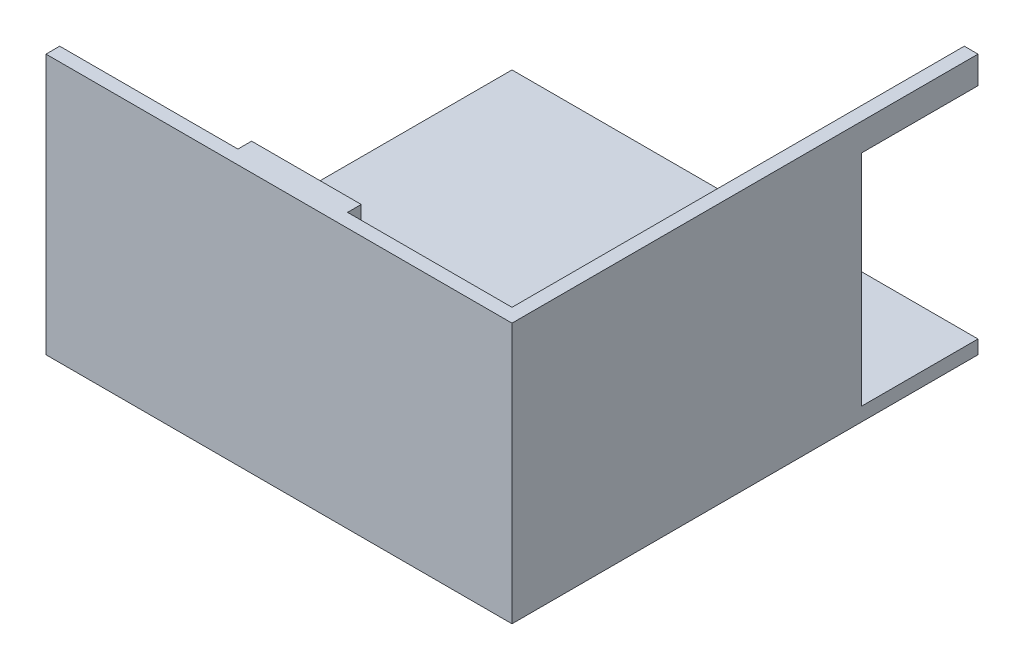
ISO-10303-21;
HEADER;
FILE_DESCRIPTION(('STEP AP214'),'2;1');
FILE_NAME('part.step','',(''),(''),'','','');
FILE_SCHEMA(('AUTOMOTIVE_DESIGN { 1 0 10303 214 1 1 1 1 }'));
ENDSEC;
DATA;
#1=APPLICATION_CONTEXT('core data for automotive mechanical design processes');
#2=APPLICATION_PROTOCOL_DEFINITION('international standard','automotive_design',2000,#1);
#3=PRODUCT_CONTEXT('',#1,'mechanical');
#4=PRODUCT('Part','Part','',(#3));
#5=PRODUCT_RELATED_PRODUCT_CATEGORY('part','',(#4));
#6=PRODUCT_DEFINITION_FORMATION('','',#4);
#7=PRODUCT_DEFINITION_CONTEXT('part definition',#1,'design');
#8=PRODUCT_DEFINITION('design','',#6,#7);
#9=PRODUCT_DEFINITION_SHAPE('','',#8);
#10=(LENGTH_UNIT() NAMED_UNIT(*) SI_UNIT(.MILLI.,.METRE.));
#11=(NAMED_UNIT(*) PLANE_ANGLE_UNIT() SI_UNIT($,.RADIAN.));
#12=(NAMED_UNIT(*) SI_UNIT($,.STERADIAN.) SOLID_ANGLE_UNIT());
#13=UNCERTAINTY_MEASURE_WITH_UNIT(LENGTH_MEASURE(1.E-05),#10,'distance_accuracy_value','');
#14=(GEOMETRIC_REPRESENTATION_CONTEXT(3) GLOBAL_UNCERTAINTY_ASSIGNED_CONTEXT((#13)) GLOBAL_UNIT_ASSIGNED_CONTEXT((#10,
#11,#12)) REPRESENTATION_CONTEXT('',''));
#15=CARTESIAN_POINT('',(0.,0.,0.));
#16=DIRECTION('',(0.,0.,1.));
#17=DIRECTION('',(1.,0.,0.));
#18=AXIS2_PLACEMENT_3D('',#15,#16,#17);
#19=CARTESIAN_POINT('',(-62.5225359911407,228.6,-371.401162790698));
#20=DIRECTION('',(0.,0.,1.));
#21=DIRECTION('',(1.,0.,0.));
#22=AXIS2_PLACEMENT_3D('',#19,#20,#21);
#23=PLANE('',#22);
#24=DIRECTION('',(-1.,0.,0.));
#25=VECTOR('',#24,1.);
#26=CARTESIAN_POINT('',(356.577464008859,0.,-371.401162790698));
#27=LINE('',#26,#25);
#28=CARTESIAN_POINT('',(369.277464008859,0.,-371.401162790698));
#29=VERTEX_POINT('',#28);
#30=CARTESIAN_POINT('',(-62.5225359911407,0.,-371.401162790698));
#31=VERTEX_POINT('',#30);
#32=EDGE_CURVE('E242',#29,#31,#27,.T.);
#33=ORIENTED_EDGE('',*,*,#32,.F.);
#34=DIRECTION('',(0.,-1.,0.));
#35=VECTOR('',#34,1.);
#36=CARTESIAN_POINT('',(369.277464008859,228.6,-371.401162790698));
#37=LINE('',#36,#35);
#38=CARTESIAN_POINT('',(369.277464008859,-12.7,-371.401162790698));
#39=VERTEX_POINT('',#38);
#40=EDGE_CURVE('E205',#29,#39,#37,.T.);
#41=ORIENTED_EDGE('',*,*,#40,.T.);
#42=DIRECTION('',(1.,0.,0.));
#43=VECTOR('',#42,1.);
#44=CARTESIAN_POINT('',(369.277464008859,-12.7,-371.401162790698));
#45=LINE('',#44,#43);
#46=CARTESIAN_POINT('',(-62.5225359911407,-12.7,-371.401162790698));
#47=VERTEX_POINT('',#46);
#48=EDGE_CURVE('E234',#47,#39,#45,.T.);
#49=ORIENTED_EDGE('',*,*,#48,.F.);
#50=DIRECTION('',(0.,-1.,0.));
#51=VECTOR('',#50,1.);
#52=CARTESIAN_POINT('',(-62.5225359911407,228.6,-371.401162790698));
#53=LINE('',#52,#51);
#54=EDGE_CURVE('E203',#31,#47,#53,.T.);
#55=ORIENTED_EDGE('',*,*,#54,.F.);
#56=EDGE_LOOP('',(#33,#41,#49,#55));
#57=FACE_BOUND('',#56,.T.);
#58=ADVANCED_FACE('F53',(#57),#23,.F.);
#59=CARTESIAN_POINT('',(356.577464008859,228.6,-371.401162790698));
#60=DIRECTION('',(-1.,0.,0.));
#61=DIRECTION('',(0.,0.,1.));
#62=AXIS2_PLACEMENT_3D('',#59,#60,#61);
#63=PLANE('',#62);
#64=DIRECTION('',(0.,0.,1.));
#65=VECTOR('',#64,1.);
#66=CARTESIAN_POINT('',(356.577464008859,203.2,-371.401162790698));
#67=LINE('',#66,#65);
#68=CARTESIAN_POINT('',(356.577464008859,203.2,-371.401162790698));
#69=VERTEX_POINT('',#68);
#70=CARTESIAN_POINT('',(356.577464008859,203.2,-263.451162790698));
#71=VERTEX_POINT('',#70);
#72=EDGE_CURVE('E175',#69,#71,#67,.T.);
#73=ORIENTED_EDGE('',*,*,#72,.T.);
#74=DIRECTION('',(0.,-1.,0.));
#75=VECTOR('',#74,1.);
#76=CARTESIAN_POINT('',(356.577464008859,203.2,-263.451162790698));
#77=LINE('',#76,#75);
#78=CARTESIAN_POINT('',(356.577464008859,0.,-263.451162790698));
#79=VERTEX_POINT('',#78);
#80=EDGE_CURVE('E159',#71,#79,#77,.T.);
#81=ORIENTED_EDGE('',*,*,#80,.T.);
#82=DIRECTION('',(0.,0.,-1.));
#83=VECTOR('',#82,1.);
#84=CARTESIAN_POINT('',(356.577464008859,0.,-371.401162790698));
#85=LINE('',#84,#83);
#86=CARTESIAN_POINT('',(356.577464008859,0.,47.6988372093023));
#87=VERTEX_POINT('',#86);
#88=EDGE_CURVE('E173',#87,#79,#85,.T.);
#89=ORIENTED_EDGE('',*,*,#88,.F.);
#90=DIRECTION('',(0.,-1.,0.));
#91=VECTOR('',#90,1.);
#92=CARTESIAN_POINT('',(356.577464008859,228.6,47.6988372093023));
#93=LINE('',#92,#91);
#94=CARTESIAN_POINT('',(356.577464008859,228.6,47.6988372093023));
#95=VERTEX_POINT('',#94);
#96=EDGE_CURVE('E194',#95,#87,#93,.T.);
#97=ORIENTED_EDGE('',*,*,#96,.F.);
#98=DIRECTION('',(0.,0.,-1.));
#99=VECTOR('',#98,1.);
#100=CARTESIAN_POINT('',(356.577464008859,228.6,-371.401162790698));
#101=LINE('',#100,#99);
#102=CARTESIAN_POINT('',(356.577464008859,228.6,-371.401162790698));
#103=VERTEX_POINT('',#102);
#104=EDGE_CURVE('E192',#95,#103,#101,.T.);
#105=ORIENTED_EDGE('',*,*,#104,.T.);
#106=DIRECTION('',(0.,-1.,0.));
#107=VECTOR('',#106,1.);
#108=CARTESIAN_POINT('',(356.577464008859,228.6,-371.401162790698));
#109=LINE('',#108,#107);
#110=EDGE_CURVE('E240',#103,#69,#109,.T.);
#111=ORIENTED_EDGE('',*,*,#110,.T.);
#112=EDGE_LOOP('',(#73,#81,#89,#97,#105,#111));
#113=FACE_BOUND('',#112,.T.);
#114=ADVANCED_FACE('F171',(#113),#63,.T.);
#115=CARTESIAN_POINT('',(-62.5225359911406,228.6,47.6988372093023));
#116=DIRECTION('',(0.,0.,-1.));
#117=DIRECTION('',(-1.,0.,0.));
#118=AXIS2_PLACEMENT_3D('',#115,#116,#117);
#119=PLANE('',#118);
#120=DIRECTION('',(1.,0.,0.));
#121=VECTOR('',#120,1.);
#122=CARTESIAN_POINT('',(-62.5225359911406,0.,47.6988372093023));
#123=LINE('',#122,#121);
#124=CARTESIAN_POINT('',(204.177464008859,0.,47.6988372093023));
#125=VERTEX_POINT('',#124);
#126=EDGE_CURVE('E180',#125,#87,#123,.T.);
#127=ORIENTED_EDGE('',*,*,#126,.F.);
#128=DIRECTION('',(0.,1.,0.));
#129=VECTOR('',#128,1.);
#130=CARTESIAN_POINT('',(204.177464008859,228.6,47.6988372093023));
#131=LINE('',#130,#129);
#132=CARTESIAN_POINT('',(204.177464008859,228.6,47.6988372093023));
#133=VERTEX_POINT('',#132);
#134=EDGE_CURVE('E247',#125,#133,#131,.T.);
#135=ORIENTED_EDGE('',*,*,#134,.T.);
#136=DIRECTION('',(1.,0.,0.));
#137=VECTOR('',#136,1.);
#138=CARTESIAN_POINT('',(-62.5225359911406,228.6,47.6988372093023));
#139=LINE('',#138,#137);
#140=EDGE_CURVE('E182',#133,#95,#139,.T.);
#141=ORIENTED_EDGE('',*,*,#140,.T.);
#142=ORIENTED_EDGE('',*,*,#96,.T.);
#143=EDGE_LOOP('',(#127,#135,#141,#142));
#144=FACE_BOUND('',#143,.T.);
#145=ADVANCED_FACE('F288',(#144),#119,.T.);
#146=CARTESIAN_POINT('',(-62.5225359911407,228.6,47.6988372093023));
#147=VERTEX_POINT('',#146);
#148=CARTESIAN_POINT('',(102.577464008859,228.6,47.6988372093023));
#149=VERTEX_POINT('',#148);
#150=EDGE_CURVE('E185',#147,#149,#139,.T.);
#151=ORIENTED_EDGE('',*,*,#150,.T.);
#152=DIRECTION('',(0.,-1.,0.));
#153=VECTOR('',#152,1.);
#154=CARTESIAN_POINT('',(102.577464008859,228.6,47.6988372093023));
#155=LINE('',#154,#153);
#156=CARTESIAN_POINT('',(102.577464008859,0.,47.6988372093023));
#157=VERTEX_POINT('',#156);
#158=EDGE_CURVE('E250',#149,#157,#155,.T.);
#159=ORIENTED_EDGE('',*,*,#158,.T.);
#160=CARTESIAN_POINT('',(-62.5225359911407,0.,47.6988372093023));
#161=VERTEX_POINT('',#160);
#162=EDGE_CURVE('E183',#161,#157,#123,.T.);
#163=ORIENTED_EDGE('',*,*,#162,.F.);
#164=DIRECTION('',(0.,-1.,0.));
#165=VECTOR('',#164,1.);
#166=CARTESIAN_POINT('',(-62.5225359911407,228.6,47.6988372093023));
#167=LINE('',#166,#165);
#168=EDGE_CURVE('E238',#147,#161,#167,.T.);
#169=ORIENTED_EDGE('',*,*,#168,.F.);
#170=EDGE_LOOP('',(#151,#159,#163,#169));
#171=FACE_BOUND('',#170,.T.);
#172=ADVANCED_FACE('F324',(#171),#119,.T.);
#173=CARTESIAN_POINT('',(369.277464008859,0.,-371.401162790698));
#174=DIRECTION('',(0.,1.,0.));
#175=DIRECTION('',(0.,0.,1.));
#176=AXIS2_PLACEMENT_3D('',#173,#174,#175);
#177=PLANE('',#176);
#178=DIRECTION('',(-1.,0.,0.));
#179=VECTOR('',#178,1.);
#180=CARTESIAN_POINT('',(153.377464008859,0.,34.9988372093023));
#181=LINE('',#180,#179);
#182=CARTESIAN_POINT('',(204.177464008859,0.,34.9988372093023));
#183=VERTEX_POINT('',#182);
#184=CARTESIAN_POINT('',(102.577464008859,0.,34.9988372093023));
#185=VERTEX_POINT('',#184);
#186=EDGE_CURVE('E68',#183,#185,#181,.T.);
#187=ORIENTED_EDGE('',*,*,#186,.F.);
#188=DIRECTION('',(0.,0.,1.));
#189=VECTOR('',#188,1.);
#190=CARTESIAN_POINT('',(204.177464008859,0.,-371.401162790698));
#191=LINE('',#190,#189);
#192=EDGE_CURVE('E12',#183,#125,#191,.T.);
#193=ORIENTED_EDGE('',*,*,#192,.T.);
#194=ORIENTED_EDGE('',*,*,#126,.T.);
#195=ORIENTED_EDGE('',*,*,#88,.T.);
#196=DIRECTION('',(1.,0.,0.));
#197=VECTOR('',#196,1.);
#198=CARTESIAN_POINT('',(356.577464008859,0.,-263.451162790698));
#199=LINE('',#198,#197);
#200=CARTESIAN_POINT('',(369.277464008859,0.,-263.451162790698));
#201=VERTEX_POINT('',#200);
#202=EDGE_CURVE('E156',#79,#201,#199,.T.);
#203=ORIENTED_EDGE('',*,*,#202,.T.);
#204=DIRECTION('',(0.,0.,-1.));
#205=VECTOR('',#204,1.);
#206=CARTESIAN_POINT('',(369.277464008859,0.,-371.401162790698));
#207=LINE('',#206,#205);
#208=EDGE_CURVE('E167',#201,#29,#207,.T.);
#209=ORIENTED_EDGE('',*,*,#208,.T.);
#210=ORIENTED_EDGE('',*,*,#32,.T.);
#211=DIRECTION('',(0.,0.,1.));
#212=VECTOR('',#211,1.);
#213=CARTESIAN_POINT('',(-62.5225359911407,0.,-371.401162790698));
#214=LINE('',#213,#212);
#215=EDGE_CURVE('E244',#31,#161,#214,.T.);
#216=ORIENTED_EDGE('',*,*,#215,.T.);
#217=ORIENTED_EDGE('',*,*,#162,.T.);
#218=DIRECTION('',(0.,0.,1.));
#219=VECTOR('',#218,1.);
#220=CARTESIAN_POINT('',(102.577464008859,0.,60.3988372093023));
#221=LINE('',#220,#219);
#222=EDGE_CURVE('E256',#185,#157,#221,.T.);
#223=ORIENTED_EDGE('',*,*,#222,.F.);
#224=EDGE_LOOP('',(#187,#193,#194,#195,#203,#209,#210,#216,#217,#223));
#225=FACE_BOUND('',#224,.T.);
#226=ADVANCED_FACE('F178',(#225),#177,.T.);
#227=CARTESIAN_POINT('',(-62.5225359911406,228.6,60.3988372093023));
#228=DIRECTION('',(0.,1.,0.));
#229=DIRECTION('',(0.,0.,1.));
#230=AXIS2_PLACEMENT_3D('',#227,#228,#229);
#231=PLANE('',#230);
#232=DIRECTION('',(1.,0.,0.));
#233=VECTOR('',#232,1.);
#234=CARTESIAN_POINT('',(-62.5225359911406,228.6,60.3988372093023));
#235=LINE('',#234,#233);
#236=CARTESIAN_POINT('',(-62.5225359911406,228.6,60.3988372093023));
#237=VERTEX_POINT('',#236);
#238=CARTESIAN_POINT('',(369.277464008859,228.6,60.3988372093023));
#239=VERTEX_POINT('',#238);
#240=EDGE_CURVE('E198',#237,#239,#235,.T.);
#241=ORIENTED_EDGE('',*,*,#240,.T.);
#242=DIRECTION('',(0.,0.,-1.));
#243=VECTOR('',#242,1.);
#244=CARTESIAN_POINT('',(369.277464008859,228.6,-371.401162790698));
#245=LINE('',#244,#243);
#246=CARTESIAN_POINT('',(369.277464008859,228.6,-371.401162790698));
#247=VERTEX_POINT('',#246);
#248=EDGE_CURVE('E76',#239,#247,#245,.T.);
#249=ORIENTED_EDGE('',*,*,#248,.T.);
#250=DIRECTION('',(-1.,0.,0.));
#251=VECTOR('',#250,1.);
#252=CARTESIAN_POINT('',(-62.5225359911407,228.6,-371.401162790698));
#253=LINE('',#252,#251);
#254=EDGE_CURVE('E201',#247,#103,#253,.T.);
#255=ORIENTED_EDGE('',*,*,#254,.T.);
#256=ORIENTED_EDGE('',*,*,#104,.F.);
#257=ORIENTED_EDGE('',*,*,#140,.F.);
#258=DIRECTION('',(0.,0.,-1.));
#259=VECTOR('',#258,1.);
#260=CARTESIAN_POINT('',(204.177464008859,228.6,60.3988372093023));
#261=LINE('',#260,#259);
#262=CARTESIAN_POINT('',(204.177464008859,228.6,34.9988372093023));
#263=VERTEX_POINT('',#262);
#264=EDGE_CURVE('E261',#133,#263,#261,.T.);
#265=ORIENTED_EDGE('',*,*,#264,.T.);
#266=DIRECTION('',(-1.,0.,0.));
#267=VECTOR('',#266,1.);
#268=CARTESIAN_POINT('',(153.377464008859,228.6,34.9988372093023));
#269=LINE('',#268,#267);
#270=CARTESIAN_POINT('',(102.577464008859,228.6,34.9988372093023));
#271=VERTEX_POINT('',#270);
#272=EDGE_CURVE('E253',#263,#271,#269,.T.);
#273=ORIENTED_EDGE('',*,*,#272,.T.);
#274=DIRECTION('',(0.,0.,1.));
#275=VECTOR('',#274,1.);
#276=CARTESIAN_POINT('',(102.577464008859,228.6,60.3988372093023));
#277=LINE('',#276,#275);
#278=EDGE_CURVE('E258',#271,#149,#277,.T.);
#279=ORIENTED_EDGE('',*,*,#278,.T.);
#280=ORIENTED_EDGE('',*,*,#150,.F.);
#281=DIRECTION('',(0.,0.,1.));
#282=VECTOR('',#281,1.);
#283=CARTESIAN_POINT('',(-62.5225359911407,228.6,-371.401162790698));
#284=LINE('',#283,#282);
#285=EDGE_CURVE('E196',#147,#237,#284,.T.);
#286=ORIENTED_EDGE('',*,*,#285,.T.);
#287=EDGE_LOOP('',(#241,#249,#255,#256,#257,#265,#273,#279,#280,#286));
#288=FACE_BOUND('',#287,.T.);
#289=ADVANCED_FACE('F300',(#288),#231,.T.);
#290=CARTESIAN_POINT('',(-62.5225359911407,228.6,-371.401162790698));
#291=DIRECTION('',(1.,0.,0.));
#292=DIRECTION('',(0.,0.,-1.));
#293=AXIS2_PLACEMENT_3D('',#290,#291,#292);
#294=PLANE('',#293);
#295=ORIENTED_EDGE('',*,*,#168,.T.);
#296=ORIENTED_EDGE('',*,*,#215,.F.);
#297=ORIENTED_EDGE('',*,*,#54,.T.);
#298=DIRECTION('',(0.,0.,-1.));
#299=VECTOR('',#298,1.);
#300=CARTESIAN_POINT('',(-62.5225359911407,-12.7,60.3988372093023));
#301=LINE('',#300,#299);
#302=CARTESIAN_POINT('',(-62.5225359911407,-12.7,60.3988372093023));
#303=VERTEX_POINT('',#302);
#304=EDGE_CURVE('E226',#303,#47,#301,.T.);
#305=ORIENTED_EDGE('',*,*,#304,.F.);
#306=DIRECTION('',(0.,-1.,0.));
#307=VECTOR('',#306,1.);
#308=CARTESIAN_POINT('',(-62.5225359911406,228.6,60.3988372093023));
#309=LINE('',#308,#307);
#310=EDGE_CURVE('E61',#237,#303,#309,.T.);
#311=ORIENTED_EDGE('',*,*,#310,.F.);
#312=ORIENTED_EDGE('',*,*,#285,.F.);
#313=EDGE_LOOP('',(#295,#296,#297,#305,#311,#312));
#314=FACE_BOUND('',#313,.T.);
#315=ADVANCED_FACE('F55',(#314),#294,.F.);
#316=CARTESIAN_POINT('',(369.277464008859,203.2,-371.401162790698));
#317=VERTEX_POINT('',#316);
#318=EDGE_CURVE('E206',#247,#317,#37,.T.);
#319=ORIENTED_EDGE('',*,*,#318,.T.);
#320=DIRECTION('',(-1.,0.,0.));
#321=VECTOR('',#320,1.);
#322=CARTESIAN_POINT('',(356.577464008859,203.2,-371.401162790698));
#323=LINE('',#322,#321);
#324=EDGE_CURVE('E268',#317,#69,#323,.T.);
#325=ORIENTED_EDGE('',*,*,#324,.T.);
#326=ORIENTED_EDGE('',*,*,#110,.F.);
#327=ORIENTED_EDGE('',*,*,#254,.F.);
#328=EDGE_LOOP('',(#319,#325,#326,#327));
#329=FACE_BOUND('',#328,.T.);
#330=ADVANCED_FACE('F283',(#329),#23,.F.);
#331=CARTESIAN_POINT('',(-62.5225359911406,228.6,60.3988372093023));
#332=DIRECTION('',(0.,0.,-1.));
#333=DIRECTION('',(-1.,0.,0.));
#334=AXIS2_PLACEMENT_3D('',#331,#332,#333);
#335=PLANE('',#334);
#336=DIRECTION('',(0.,-1.,0.));
#337=VECTOR('',#336,1.);
#338=CARTESIAN_POINT('',(369.277464008859,228.6,60.3988372093023));
#339=LINE('',#338,#337);
#340=CARTESIAN_POINT('',(369.277464008859,-12.7,60.3988372093023));
#341=VERTEX_POINT('',#340);
#342=EDGE_CURVE('E209',#239,#341,#339,.T.);
#343=ORIENTED_EDGE('',*,*,#342,.F.);
#344=ORIENTED_EDGE('',*,*,#240,.F.);
#345=ORIENTED_EDGE('',*,*,#310,.T.);
#346=DIRECTION('',(-1.,0.,0.));
#347=VECTOR('',#346,1.);
#348=CARTESIAN_POINT('',(369.277464008859,-12.7,60.3988372093023));
#349=LINE('',#348,#347);
#350=EDGE_CURVE('E217',#341,#303,#349,.T.);
#351=ORIENTED_EDGE('',*,*,#350,.F.);
#352=EDGE_LOOP('',(#343,#344,#345,#351));
#353=FACE_BOUND('',#352,.T.);
#354=ADVANCED_FACE('F216',(#353),#335,.F.);
#355=CARTESIAN_POINT('',(369.277464008859,228.6,-371.401162790698));
#356=DIRECTION('',(-1.,0.,0.));
#357=DIRECTION('',(0.,0.,1.));
#358=AXIS2_PLACEMENT_3D('',#355,#356,#357);
#359=PLANE('',#358);
#360=DIRECTION('',(0.,-1.,0.));
#361=VECTOR('',#360,1.);
#362=CARTESIAN_POINT('',(369.277464008859,203.2,-263.451162790698));
#363=LINE('',#362,#361);
#364=CARTESIAN_POINT('',(369.277464008859,203.2,-263.451162790698));
#365=VERTEX_POINT('',#364);
#366=EDGE_CURVE('E162',#365,#201,#363,.T.);
#367=ORIENTED_EDGE('',*,*,#366,.F.);
#368=DIRECTION('',(0.,0.,-1.));
#369=VECTOR('',#368,1.);
#370=CARTESIAN_POINT('',(369.277464008859,203.2,-371.401162790698));
#371=LINE('',#370,#369);
#372=EDGE_CURVE('E271',#365,#317,#371,.T.);
#373=ORIENTED_EDGE('',*,*,#372,.T.);
#374=ORIENTED_EDGE('',*,*,#318,.F.);
#375=ORIENTED_EDGE('',*,*,#248,.F.);
#376=ORIENTED_EDGE('',*,*,#342,.T.);
#377=DIRECTION('',(0.,0.,1.));
#378=VECTOR('',#377,1.);
#379=CARTESIAN_POINT('',(369.277464008859,-12.7,60.3988372093023));
#380=LINE('',#379,#378);
#381=EDGE_CURVE('E229',#39,#341,#380,.T.);
#382=ORIENTED_EDGE('',*,*,#381,.F.);
#383=ORIENTED_EDGE('',*,*,#40,.F.);
#384=ORIENTED_EDGE('',*,*,#208,.F.);
#385=EDGE_LOOP('',(#367,#373,#374,#375,#376,#382,#383,#384));
#386=FACE_BOUND('',#385,.T.);
#387=ADVANCED_FACE('F279',(#386),#359,.F.);
#388=CARTESIAN_POINT('',(369.277464008859,-12.7,-371.401162790698));
#389=DIRECTION('',(0.,1.,0.));
#390=DIRECTION('',(0.,0.,1.));
#391=AXIS2_PLACEMENT_3D('',#388,#389,#390);
#392=PLANE('',#391);
#393=ORIENTED_EDGE('',*,*,#381,.T.);
#394=ORIENTED_EDGE('',*,*,#350,.T.);
#395=ORIENTED_EDGE('',*,*,#304,.T.);
#396=ORIENTED_EDGE('',*,*,#48,.T.);
#397=EDGE_LOOP('',(#393,#394,#395,#396));
#398=FACE_BOUND('',#397,.T.);
#399=ADVANCED_FACE('F224',(#398),#392,.F.);
#400=CARTESIAN_POINT('',(204.177464008859,333.326882890689,60.3988372093023));
#401=DIRECTION('',(-1.,0.,0.));
#402=DIRECTION('',(0.,0.,1.));
#403=AXIS2_PLACEMENT_3D('',#400,#401,#402);
#404=PLANE('',#403);
#405=ORIENTED_EDGE('',*,*,#134,.F.);
#406=ORIENTED_EDGE('',*,*,#192,.F.);
#407=DIRECTION('',(0.,-1.,0.));
#408=VECTOR('',#407,1.);
#409=CARTESIAN_POINT('',(204.177464008859,333.326882890689,34.9988372093023));
#410=LINE('',#409,#408);
#411=EDGE_CURVE('E176',#263,#183,#410,.T.);
#412=ORIENTED_EDGE('',*,*,#411,.F.);
#413=ORIENTED_EDGE('',*,*,#264,.F.);
#414=EDGE_LOOP('',(#405,#406,#412,#413));
#415=FACE_BOUND('',#414,.T.);
#416=ADVANCED_FACE('F319',(#415),#404,.F.);
#417=CARTESIAN_POINT('',(153.377464008859,333.326882890689,34.9988372093023));
#418=DIRECTION('',(0.,0.,1.));
#419=DIRECTION('',(1.,0.,0.));
#420=AXIS2_PLACEMENT_3D('',#417,#418,#419);
#421=PLANE('',#420);
#422=ORIENTED_EDGE('',*,*,#272,.F.);
#423=ORIENTED_EDGE('',*,*,#411,.T.);
#424=ORIENTED_EDGE('',*,*,#186,.T.);
#425=DIRECTION('',(0.,-1.,0.));
#426=VECTOR('',#425,1.);
#427=CARTESIAN_POINT('',(102.577464008859,333.326882890689,34.9988372093023));
#428=LINE('',#427,#426);
#429=EDGE_CURVE('E254',#271,#185,#428,.T.);
#430=ORIENTED_EDGE('',*,*,#429,.F.);
#431=EDGE_LOOP('',(#422,#423,#424,#430));
#432=FACE_BOUND('',#431,.T.);
#433=ADVANCED_FACE('F315',(#432),#421,.F.);
#434=CARTESIAN_POINT('',(102.577464008859,333.326882890689,60.3988372093023));
#435=DIRECTION('',(1.,0.,0.));
#436=DIRECTION('',(0.,0.,-1.));
#437=AXIS2_PLACEMENT_3D('',#434,#435,#436);
#438=PLANE('',#437);
#439=ORIENTED_EDGE('',*,*,#158,.F.);
#440=ORIENTED_EDGE('',*,*,#278,.F.);
#441=ORIENTED_EDGE('',*,*,#429,.T.);
#442=ORIENTED_EDGE('',*,*,#222,.T.);
#443=EDGE_LOOP('',(#439,#440,#441,#442));
#444=FACE_BOUND('',#443,.T.);
#445=ADVANCED_FACE('F311',(#444),#438,.F.);
#446=CARTESIAN_POINT('',(356.577464008859,203.2,-263.451162790698));
#447=DIRECTION('',(0.,0.,-1.));
#448=DIRECTION('',(-1.,0.,0.));
#449=AXIS2_PLACEMENT_3D('',#446,#447,#448);
#450=PLANE('',#449);
#451=ORIENTED_EDGE('',*,*,#202,.F.);
#452=ORIENTED_EDGE('',*,*,#80,.F.);
#453=DIRECTION('',(1.,0.,0.));
#454=VECTOR('',#453,1.);
#455=CARTESIAN_POINT('',(356.577464008859,203.2,-263.451162790698));
#456=LINE('',#455,#454);
#457=EDGE_CURVE('E274',#71,#365,#456,.T.);
#458=ORIENTED_EDGE('',*,*,#457,.T.);
#459=ORIENTED_EDGE('',*,*,#366,.T.);
#460=EDGE_LOOP('',(#451,#452,#458,#459));
#461=FACE_BOUND('',#460,.T.);
#462=ADVANCED_FACE('F158',(#461),#450,.T.);
#463=CARTESIAN_POINT('',(356.577464008859,203.2,-263.451162790698));
#464=DIRECTION('',(0.,1.,0.));
#465=DIRECTION('',(0.,0.,1.));
#466=AXIS2_PLACEMENT_3D('',#463,#464,#465);
#467=PLANE('',#466);
#468=ORIENTED_EDGE('',*,*,#72,.F.);
#469=ORIENTED_EDGE('',*,*,#324,.F.);
#470=ORIENTED_EDGE('',*,*,#372,.F.);
#471=ORIENTED_EDGE('',*,*,#457,.F.);
#472=EDGE_LOOP('',(#468,#469,#470,#471));
#473=FACE_BOUND('',#472,.T.);
#474=ADVANCED_FACE('F305',(#473),#467,.F.);
#475=CLOSED_SHELL('',(#58,#114,#145,#172,#226,#289,#315,#330,#354,#387,#399,#416,#433,#445,#462,#474));
#476=MANIFOLD_SOLID_BREP('B2',#475);
#477=ADVANCED_BREP_SHAPE_REPRESENTATION('',(#18,#476),#14);
#478=SHAPE_DEFINITION_REPRESENTATION(#9,#477);
ENDSEC;
END-ISO-10303-21;
